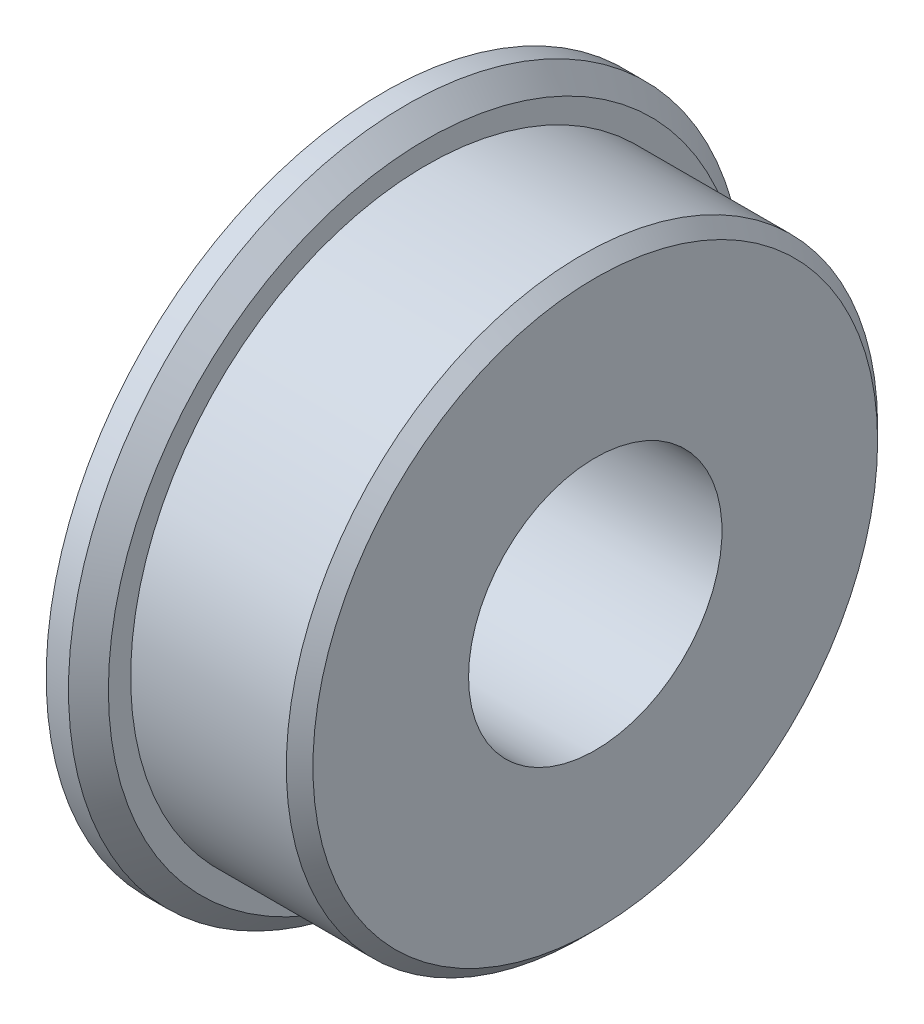
ISO-10303-21;
HEADER;
FILE_DESCRIPTION(('STEP AP214'),'2;1');
FILE_NAME('part.step','',(''),(''),'','','');
FILE_SCHEMA(('AUTOMOTIVE_DESIGN { 1 0 10303 214 1 1 1 1 }'));
ENDSEC;
DATA;
#1=APPLICATION_CONTEXT('core data for automotive mechanical design processes');
#2=APPLICATION_PROTOCOL_DEFINITION('international standard','automotive_design',2000,#1);
#3=PRODUCT_CONTEXT('',#1,'mechanical');
#4=PRODUCT('Part','Part','',(#3));
#5=PRODUCT_RELATED_PRODUCT_CATEGORY('part','',(#4));
#6=PRODUCT_DEFINITION_FORMATION('','',#4);
#7=PRODUCT_DEFINITION_CONTEXT('part definition',#1,'design');
#8=PRODUCT_DEFINITION('design','',#6,#7);
#9=PRODUCT_DEFINITION_SHAPE('','',#8);
#10=(LENGTH_UNIT() NAMED_UNIT(*) SI_UNIT(.MILLI.,.METRE.));
#11=(NAMED_UNIT(*) PLANE_ANGLE_UNIT() SI_UNIT($,.RADIAN.));
#12=(NAMED_UNIT(*) SI_UNIT($,.STERADIAN.) SOLID_ANGLE_UNIT());
#13=UNCERTAINTY_MEASURE_WITH_UNIT(LENGTH_MEASURE(1.E-05),#10,'distance_accuracy_value','');
#14=(GEOMETRIC_REPRESENTATION_CONTEXT(3) GLOBAL_UNCERTAINTY_ASSIGNED_CONTEXT((#13)) GLOBAL_UNIT_ASSIGNED_CONTEXT((#10,
#11,#12)) REPRESENTATION_CONTEXT('',''));
#15=CARTESIAN_POINT('',(0.,0.,0.));
#16=DIRECTION('',(0.,0.,1.));
#17=DIRECTION('',(1.,0.,0.));
#18=AXIS2_PLACEMENT_3D('',#15,#16,#17);
#19=CARTESIAN_POINT('',(3.175,0.,0.));
#20=DIRECTION('',(-1.,0.,0.));
#21=DIRECTION('',(0.,0.,1.));
#22=AXIS2_PLACEMENT_3D('',#19,#20,#21);
#23=CYLINDRICAL_SURFACE('',#22,25.4);
#24=CARTESIAN_POINT('',(1.675,0.,0.));
#25=DIRECTION('',(1.,0.,0.));
#26=DIRECTION('',(0.,0.,-1.));
#27=AXIS2_PLACEMENT_3D('',#24,#25,#26);
#28=CIRCLE('',#27,25.4);
#29=CARTESIAN_POINT('',(1.675,0.,-25.4));
#30=VERTEX_POINT('',#29);
#31=EDGE_CURVE('E52',#30,#30,#28,.F.);
#32=ORIENTED_EDGE('',*,*,#31,.T.);
#33=EDGE_LOOP('',(#32));
#34=FACE_BOUND('',#33,.T.);
#35=CARTESIAN_POINT('',(0.,0.,0.));
#36=DIRECTION('',(1.,0.,0.));
#37=DIRECTION('',(0.,0.,-1.));
#38=AXIS2_PLACEMENT_3D('',#35,#36,#37);
#39=CIRCLE('',#38,25.4);
#40=CARTESIAN_POINT('',(0.,0.,-25.4));
#41=VERTEX_POINT('',#40);
#42=EDGE_CURVE('E62',#41,#41,#39,.T.);
#43=ORIENTED_EDGE('',*,*,#42,.T.);
#44=EDGE_LOOP('',(#43));
#45=FACE_BOUND('',#44,.T.);
#46=ADVANCED_FACE('F40',(#34,#45),#23,.T.);
#47=CARTESIAN_POINT('',(3.175,0.,0.));
#48=DIRECTION('',(1.,0.,0.));
#49=DIRECTION('',(0.,0.,-1.));
#50=AXIS2_PLACEMENT_3D('',#47,#48,#49);
#51=PLANE('',#50);
#52=CARTESIAN_POINT('',(3.175,0.,0.));
#53=DIRECTION('',(1.,0.,0.));
#54=DIRECTION('',(0.,0.,-1.));
#55=AXIS2_PLACEMENT_3D('',#52,#53,#54);
#56=CIRCLE('',#55,23.9);
#57=CARTESIAN_POINT('',(3.175,0.,-23.9));
#58=VERTEX_POINT('',#57);
#59=EDGE_CURVE('E56',#58,#58,#56,.T.);
#60=ORIENTED_EDGE('',*,*,#59,.T.);
#61=EDGE_LOOP('',(#60));
#62=FACE_BOUND('',#61,.T.);
#63=CARTESIAN_POINT('',(3.175,0.,0.));
#64=DIRECTION('',(1.,0.,0.));
#65=DIRECTION('',(0.,0.,-1.));
#66=AXIS2_PLACEMENT_3D('',#63,#64,#65);
#67=CIRCLE('',#66,22.225);
#68=CARTESIAN_POINT('',(3.175,0.,-22.225));
#69=VERTEX_POINT('',#68);
#70=EDGE_CURVE('E61',#69,#69,#67,.T.);
#71=ORIENTED_EDGE('',*,*,#70,.F.);
#72=EDGE_LOOP('',(#71));
#73=FACE_BOUND('',#72,.T.);
#74=ADVANCED_FACE('F87',(#62,#73),#51,.T.);
#75=CARTESIAN_POINT('',(0.,0.,0.));
#76=DIRECTION('',(1.,0.,0.));
#77=DIRECTION('',(0.,0.,-1.));
#78=AXIS2_PLACEMENT_3D('',#75,#76,#77);
#79=PLANE('',#78);
#80=CARTESIAN_POINT('',(0.,0.,0.));
#81=DIRECTION('',(-1.,0.,0.));
#82=DIRECTION('',(0.,0.,1.));
#83=AXIS2_PLACEMENT_3D('',#80,#81,#82);
#84=CIRCLE('',#83,9.525);
#85=CARTESIAN_POINT('',(0.,0.,9.525));
#86=VERTEX_POINT('',#85);
#87=EDGE_CURVE('E68',#86,#86,#84,.T.);
#88=ORIENTED_EDGE('',*,*,#87,.F.);
#89=EDGE_LOOP('',(#88));
#90=FACE_BOUND('',#89,.T.);
#91=ORIENTED_EDGE('',*,*,#42,.F.);
#92=EDGE_LOOP('',(#91));
#93=FACE_BOUND('',#92,.T.);
#94=ADVANCED_FACE('F83',(#90,#93),#79,.F.);
#95=CARTESIAN_POINT('',(15.875,0.,0.));
#96=DIRECTION('',(-1.,0.,0.));
#97=DIRECTION('',(0.,0.,1.));
#98=AXIS2_PLACEMENT_3D('',#95,#96,#97);
#99=CYLINDRICAL_SURFACE('',#98,22.225);
#100=CARTESIAN_POINT('',(14.875,0.,0.));
#101=DIRECTION('',(1.,0.,0.));
#102=DIRECTION('',(0.,0.,-1.));
#103=AXIS2_PLACEMENT_3D('',#100,#101,#102);
#104=CIRCLE('',#103,22.225);
#105=CARTESIAN_POINT('',(14.875,0.,-22.225));
#106=VERTEX_POINT('',#105);
#107=EDGE_CURVE('E10',#106,#106,#104,.F.);
#108=ORIENTED_EDGE('',*,*,#107,.T.);
#109=EDGE_LOOP('',(#108));
#110=FACE_BOUND('',#109,.T.);
#111=ORIENTED_EDGE('',*,*,#70,.T.);
#112=EDGE_LOOP('',(#111));
#113=FACE_BOUND('',#112,.T.);
#114=ADVANCED_FACE('F86',(#110,#113),#99,.T.);
#115=CARTESIAN_POINT('',(15.875,0.,0.));
#116=DIRECTION('',(1.,0.,0.));
#117=DIRECTION('',(0.,0.,-1.));
#118=AXIS2_PLACEMENT_3D('',#115,#116,#117);
#119=PLANE('',#118);
#120=CARTESIAN_POINT('',(15.875,0.,0.));
#121=DIRECTION('',(1.,0.,0.));
#122=DIRECTION('',(0.,0.,-1.));
#123=AXIS2_PLACEMENT_3D('',#120,#121,#122);
#124=CIRCLE('',#123,21.225);
#125=CARTESIAN_POINT('',(15.875,0.,-21.225));
#126=VERTEX_POINT('',#125);
#127=EDGE_CURVE('E48',#126,#126,#124,.T.);
#128=ORIENTED_EDGE('',*,*,#127,.T.);
#129=EDGE_LOOP('',(#128));
#130=FACE_BOUND('',#129,.T.);
#131=CARTESIAN_POINT('',(15.875,0.,0.));
#132=DIRECTION('',(-1.,0.,0.));
#133=DIRECTION('',(0.,0.,1.));
#134=AXIS2_PLACEMENT_3D('',#131,#132,#133);
#135=CIRCLE('',#134,9.525);
#136=CARTESIAN_POINT('',(15.875,0.,9.525));
#137=VERTEX_POINT('',#136);
#138=EDGE_CURVE('E65',#137,#137,#135,.T.);
#139=ORIENTED_EDGE('',*,*,#138,.T.);
#140=EDGE_LOOP('',(#139));
#141=FACE_BOUND('',#140,.T.);
#142=ADVANCED_FACE('F74',(#130,#141),#119,.T.);
#143=CARTESIAN_POINT('',(15.875,0.,0.));
#144=DIRECTION('',(-1.,0.,0.));
#145=DIRECTION('',(0.,0.,1.));
#146=AXIS2_PLACEMENT_3D('',#143,#144,#145);
#147=CYLINDRICAL_SURFACE('',#146,9.525);
#148=ORIENTED_EDGE('',*,*,#138,.F.);
#149=EDGE_LOOP('',(#148));
#150=FACE_BOUND('',#149,.T.);
#151=ORIENTED_EDGE('',*,*,#87,.T.);
#152=EDGE_LOOP('',(#151));
#153=FACE_BOUND('',#152,.T.);
#154=ADVANCED_FACE('F76',(#150,#153),#147,.F.);
#155=CARTESIAN_POINT('',(3.175,0.,0.));
#156=DIRECTION('',(-1.,0.,0.));
#157=DIRECTION('',(0.,0.,1.));
#158=AXIS2_PLACEMENT_3D('',#155,#156,#157);
#159=CONICAL_SURFACE('',#158,23.9,0.785398163397443);
#160=ORIENTED_EDGE('',*,*,#31,.F.);
#161=EDGE_LOOP('',(#160));
#162=FACE_BOUND('',#161,.T.);
#163=ORIENTED_EDGE('',*,*,#59,.F.);
#164=EDGE_LOOP('',(#163));
#165=FACE_BOUND('',#164,.T.);
#166=ADVANCED_FACE('F79',(#162,#165),#159,.T.);
#167=CARTESIAN_POINT('',(15.875,0.,0.));
#168=DIRECTION('',(-1.,0.,0.));
#169=DIRECTION('',(0.,0.,1.));
#170=AXIS2_PLACEMENT_3D('',#167,#168,#169);
#171=CONICAL_SURFACE('',#170,21.225,0.785398163397445);
#172=ORIENTED_EDGE('',*,*,#107,.F.);
#173=EDGE_LOOP('',(#172));
#174=FACE_BOUND('',#173,.T.);
#175=ORIENTED_EDGE('',*,*,#127,.F.);
#176=EDGE_LOOP('',(#175));
#177=FACE_BOUND('',#176,.T.);
#178=ADVANCED_FACE('F43',(#174,#177),#171,.T.);
#179=CLOSED_SHELL('',(#46,#74,#94,#114,#142,#154,#166,#178));
#180=MANIFOLD_SOLID_BREP('B2',#179);
#181=ADVANCED_BREP_SHAPE_REPRESENTATION('',(#18,#180),#14);
#182=SHAPE_DEFINITION_REPRESENTATION(#9,#181);
ENDSEC;
END-ISO-10303-21;
